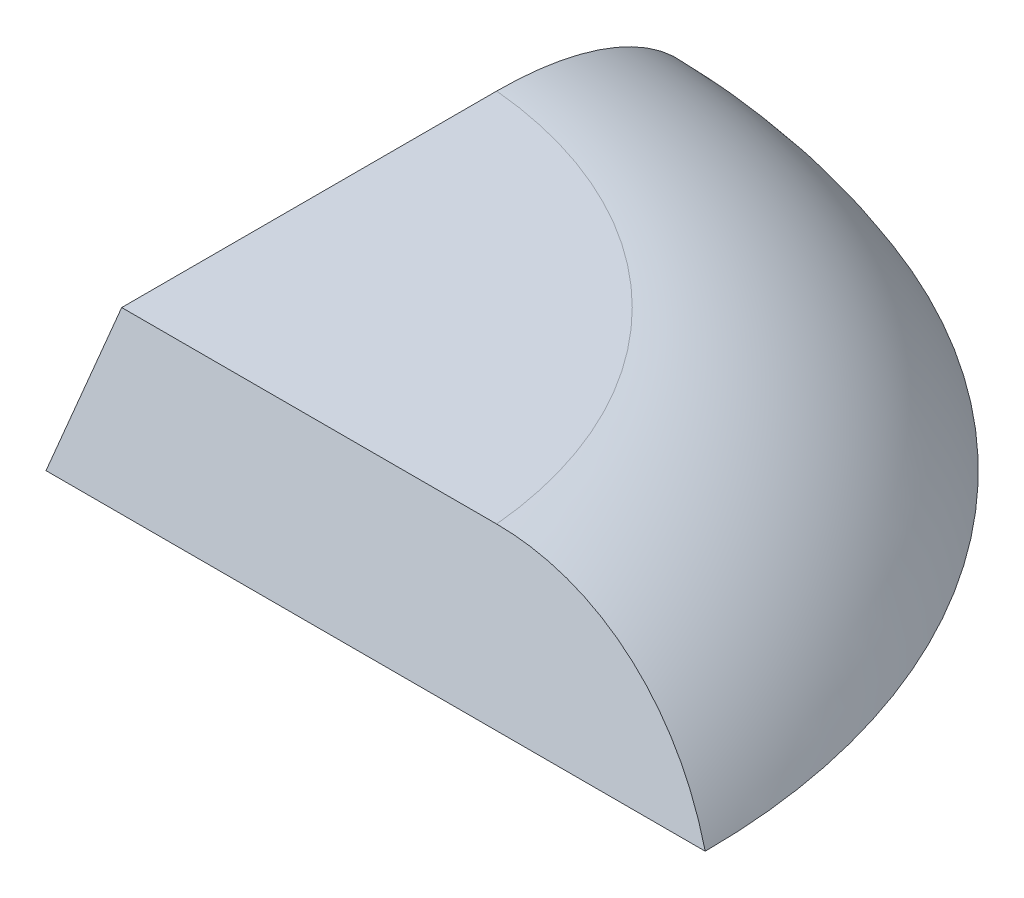
ISO-10303-21;
HEADER;
FILE_DESCRIPTION(('STEP AP214'),'2;1');
FILE_NAME('part.step','',(''),(''),'','','');
FILE_SCHEMA(('AUTOMOTIVE_DESIGN { 1 0 10303 214 1 1 1 1 }'));
ENDSEC;
DATA;
#1=APPLICATION_CONTEXT('core data for automotive mechanical design processes');
#2=APPLICATION_PROTOCOL_DEFINITION('international standard','automotive_design',2000,#1);
#3=PRODUCT_CONTEXT('',#1,'mechanical');
#4=PRODUCT('Part','Part','',(#3));
#5=PRODUCT_RELATED_PRODUCT_CATEGORY('part','',(#4));
#6=PRODUCT_DEFINITION_FORMATION('','',#4);
#7=PRODUCT_DEFINITION_CONTEXT('part definition',#1,'design');
#8=PRODUCT_DEFINITION('design','',#6,#7);
#9=PRODUCT_DEFINITION_SHAPE('','',#8);
#10=(LENGTH_UNIT() NAMED_UNIT(*) SI_UNIT(.MILLI.,.METRE.));
#11=(NAMED_UNIT(*) PLANE_ANGLE_UNIT() SI_UNIT($,.RADIAN.));
#12=(NAMED_UNIT(*) SI_UNIT($,.STERADIAN.) SOLID_ANGLE_UNIT());
#13=UNCERTAINTY_MEASURE_WITH_UNIT(LENGTH_MEASURE(1.E-05),#10,'distance_accuracy_value','');
#14=(GEOMETRIC_REPRESENTATION_CONTEXT(3) GLOBAL_UNCERTAINTY_ASSIGNED_CONTEXT((#13)) GLOBAL_UNIT_ASSIGNED_CONTEXT((#10,
#11,#12)) REPRESENTATION_CONTEXT('',''));
#15=CARTESIAN_POINT('',(0.,0.,0.));
#16=DIRECTION('',(0.,0.,1.));
#17=DIRECTION('',(1.,0.,0.));
#18=AXIS2_PLACEMENT_3D('',#15,#16,#17);
#19=CARTESIAN_POINT('',(-17.0441837358943,0.,17.0441837358943));
#20=DIRECTION('',(0.,0.258819045102521,0.965925826289068));
#21=DIRECTION('',(0.,-0.965925826289068,0.258819045102521));
#22=AXIS2_PLACEMENT_3D('',#19,#20,#21);
#23=PLANE('',#22);
#24=DIRECTION('',(1.,0.,0.));
#25=VECTOR('',#24,1.);
#26=CARTESIAN_POINT('',(-17.0441837358943,0.,17.0441837358943));
#27=LINE('',#26,#25);
#28=CARTESIAN_POINT('',(-17.0441837358943,0.,17.0441837358943));
#29=VERTEX_POINT('',#28);
#30=CARTESIAN_POINT('',(-3.04418373589434,0.,17.0441837358943));
#31=VERTEX_POINT('',#30);
#32=EDGE_CURVE('E75',#29,#31,#27,.T.);
#33=ORIENTED_EDGE('',*,*,#32,.T.);
#34=CARTESIAN_POINT('',(-3.04418373589434,0.,17.0441837358943));
#35=CARTESIAN_POINT('',(-3.12753855661707,0.144409872264248,17.0054892272421));
#36=CARTESIAN_POINT('',(-3.21716871842496,0.285440991333556,16.9677000527798));
#37=CARTESIAN_POINT('',(-3.40832179002279,0.559775219056655,16.8941924180052));
#38=CARTESIAN_POINT('',(-3.50984493036635,0.693078177819809,16.8584739978559));
#39=CARTESIAN_POINT('',(-3.72405839763664,0.95090246233359,16.7893901890313));
#40=CARTESIAN_POINT('',(-3.8367419813405,1.07542901393416,16.7560234000937));
#41=CARTESIAN_POINT('',(-4.0725573785878,1.3148757815413,16.6918638320831));
#42=CARTESIAN_POINT('',(-4.19568885844701,1.42979630411208,16.6610709708665));
#43=CARTESIAN_POINT('',(-4.45165223664817,1.64925747229645,16.6022665280815));
#44=CARTESIAN_POINT('',(-4.58449084130876,1.75379082183612,16.5742569014902));
#45=CARTESIAN_POINT('',(-4.85887380193164,1.95159602197242,16.521255157855));
#46=CARTESIAN_POINT('',(-5.00041825630385,2.04486774523362,16.4962630749305));
#47=CARTESIAN_POINT('',(-5.29127271156627,2.2194588199678,16.4494815374498));
#48=CARTESIAN_POINT('',(-5.44058554013154,2.30077377740343,16.4276932602724));
#49=CARTESIAN_POINT('',(-5.74586071165762,2.4507606302755,16.38750440417));
#50=CARTESIAN_POINT('',(-5.90182267535026,2.51943324564884,16.3691036323386));
#51=CARTESIAN_POINT('',(-6.21774895963203,2.64297899311939,16.3359996490756));
#52=CARTESIAN_POINT('',(-6.37766020548148,2.69797876791152,16.3212625038361));
#53=CARTESIAN_POINT('',(-6.70176210813462,2.79456735805591,16.2953816691089));
#54=CARTESIAN_POINT('',(-6.86595253512457,2.83615689200864,16.2842377870727));
#55=CARTESIAN_POINT('',(-7.19708281053465,2.90548771225778,16.2656606497763));
#56=CARTESIAN_POINT('',(-7.36401644589814,2.93325675926462,16.2582199560562));
#57=CARTESIAN_POINT('',(-7.69966359261924,2.97478572499434,16.2470923032265));
#58=CARTESIAN_POINT('',(-7.86837580936791,2.98855520651872,16.2434027817718));
#59=CARTESIAN_POINT('',(-8.07728354144956,2.99683347228626,16.2411846271447));
#60=CARTESIAN_POINT('',(-8.11725874476096,2.99802119211297,16.2408663785763));
#61=CARTESIAN_POINT('',(-8.19719178454703,2.99960397789834,16.2404422724033));
#62=CARTESIAN_POINT('',(-8.23714960666078,2.9999997205014,16.2403362334924));
#63=CARTESIAN_POINT('',(-8.27711117792529,3.,16.240336158601));
#64=B_SPLINE_CURVE_WITH_KNOTS('',3,(#34,#35,#36,#37,#38,#39,#40,#41,#42,#43,#44,#45,#46,#47,#48,
#49,#50,#51,#52,#53,#54,#55,#56,#57,#58,#59,#60,#61,#62,#63),.UNSPECIFIED.,.F.,.F.,(4,2,2,2,2,2,
2,2,2,2,2,2,2,2,4),(0.,0.51336529775215,1.02674054909256,1.53980748593984,2.05285804265174,
2.56626646187149,3.07968068566677,3.59328311697483,4.10685629137846,4.61547872762745,
5.12407390433009,5.63164331916973,6.1388657908688,6.25884346569189,6.37871859092539),.UNSPECIFIED.);
#65=CARTESIAN_POINT('',(-8.2771111779253,3.,16.240336158601));
#66=VERTEX_POINT('',#65);
#67=EDGE_CURVE('E11',#31,#66,#64,.T.);
#68=ORIENTED_EDGE('',*,*,#67,.T.);
#69=DIRECTION('',(-1.,0.,0.));
#70=VECTOR('',#69,1.);
#71=CARTESIAN_POINT('',(-17.0441837358943,3.,16.240336158601));
#72=LINE('',#71,#70);
#73=CARTESIAN_POINT('',(-16.240336158601,3.,16.240336158601));
#74=VERTEX_POINT('',#73);
#75=EDGE_CURVE('E106',#74,#66,#72,.F.);
#76=ORIENTED_EDGE('',*,*,#75,.F.);
#77=DIRECTION('',(-0.250562807085732,-0.935113126531029,0.250562807085732));
#78=VECTOR('',#77,1.);
#79=CARTESIAN_POINT('',(-17.0441837358943,0.,17.0441837358943));
#80=LINE('',#79,#78);
#81=EDGE_CURVE('E80',#74,#29,#80,.T.);
#82=ORIENTED_EDGE('',*,*,#81,.T.);
#83=EDGE_LOOP('',(#33,#68,#76,#82));
#84=FACE_BOUND('',#83,.T.);
#85=ADVANCED_FACE('F33',(#84),#23,.T.);
#86=CARTESIAN_POINT('',(-17.0441837358943,0.,3.04418373589434));
#87=DIRECTION('',(-0.965925826289068,0.258819045102521,0.));
#88=DIRECTION('',(-0.258819045102521,-0.965925826289068,0.));
#89=AXIS2_PLACEMENT_3D('',#86,#87,#88);
#90=PLANE('',#89);
#91=DIRECTION('',(0.,0.,-1.));
#92=VECTOR('',#91,1.);
#93=CARTESIAN_POINT('',(-16.240336158601,3.,17.0441837358943));
#94=LINE('',#93,#92);
#95=CARTESIAN_POINT('',(-16.240336158601,3.,8.2771111779253));
#96=VERTEX_POINT('',#95);
#97=EDGE_CURVE('E86',#96,#74,#94,.F.);
#98=ORIENTED_EDGE('',*,*,#97,.F.);
#99=CARTESIAN_POINT('',(-16.240336158601,3.,8.27711117792529));
#100=CARTESIAN_POINT('',(-16.2403289912065,3.00002674908014,8.08872289268257));
#101=CARTESIAN_POINT('',(-16.2426935081103,2.99120225186007,7.90035435335059));
#102=CARTESIAN_POINT('',(-16.2520860590193,2.95614877465473,7.5253769539243));
#103=CARTESIAN_POINT('',(-16.259113646184,2.92992146230175,7.33876792696151));
#104=CARTESIAN_POINT('',(-16.2777145209522,2.86050205260134,6.96974675282083));
#105=CARTESIAN_POINT('',(-16.2892691594512,2.81737955466017,6.78732059707294));
#106=CARTESIAN_POINT('',(-16.3167854048291,2.71468752887634,6.42757085679597));
#107=CARTESIAN_POINT('',(-16.3327465044678,2.65511989407983,6.25024668755554));
#108=CARTESIAN_POINT('',(-16.382834050082,2.46819062902138,5.76839607881451));
#109=CARTESIAN_POINT('',(-16.4214991016677,2.32389069202613,5.4707258319329));
#110=CARTESIAN_POINT('',(-16.5110112911173,1.98982665310356,4.90399510867711));
#111=CARTESIAN_POINT('',(-16.5618627657157,1.80004636626267,4.63494486651751));
#112=CARTESIAN_POINT('',(-16.6480800830082,1.47827895763465,4.2494845638597));
#113=CARTESIAN_POINT('',(-16.6796725093627,1.36037441734532,4.12020744953998));
#114=CARTESIAN_POINT('',(-16.7456713883541,1.11406324770669,3.87277521593978));
#115=CARTESIAN_POINT('',(-16.780078109001,0.985655618130899,3.75462115823628));
#116=CARTESIAN_POINT('',(-16.8514781899502,0.719186888364002,3.53019347174576));
#117=CARTESIAN_POINT('',(-16.8884753679903,0.581111540181367,3.42393800431209));
#118=CARTESIAN_POINT('',(-16.9647166068942,0.296575362960204,3.22425730129206));
#119=CARTESIAN_POINT('',(-17.0039604981618,0.150115166862666,3.13083109907682));
#120=CARTESIAN_POINT('',(-17.0441837358943,0.,3.04418373589433));
#121=B_SPLINE_CURVE_WITH_KNOTS('',3,(#99,#100,#101,#102,#103,#104,#105,#106,#107,#108,#109,#110,
#111,#112,#113,#114,#115,#116,#117,#118,#119,#120),.UNSPECIFIED.,.F.,.F.,(4,2,2,2,2,2,2,2,2,2,
4),(0.,0.564912318622437,1.12977051209366,1.69232584350891,2.25481644457329,3.24913503410561,
4.24380799471296,4.77661936889812,5.30948154279587,5.84314627026064,6.37677076634037),.UNSPECIFIED.);
#122=CARTESIAN_POINT('',(-17.0441837358943,0.,3.04418373589434));
#123=VERTEX_POINT('',#122);
#124=EDGE_CURVE('E46',#96,#123,#121,.T.);
#125=ORIENTED_EDGE('',*,*,#124,.T.);
#126=DIRECTION('',(0.,0.,1.));
#127=VECTOR('',#126,1.);
#128=CARTESIAN_POINT('',(-17.0441837358943,0.,3.04418373589434));
#129=LINE('',#128,#127);
#130=EDGE_CURVE('E76',#123,#29,#129,.T.);
#131=ORIENTED_EDGE('',*,*,#130,.T.);
#132=ORIENTED_EDGE('',*,*,#81,.F.);
#133=EDGE_LOOP('',(#98,#125,#131,#132));
#134=FACE_BOUND('',#133,.T.);
#135=ADVANCED_FACE('F93',(#134),#90,.T.);
#136=CARTESIAN_POINT('',(-17.0441837358943,3.,17.0441837358943));
#137=DIRECTION('',(0.,-1.,0.));
#138=DIRECTION('',(0.,0.,-1.));
#139=AXIS2_PLACEMENT_3D('',#136,#137,#138);
#140=PLANE('',#139);
#141=ORIENTED_EDGE('',*,*,#75,.T.);
#142=CARTESIAN_POINT('',(-17.0441837358943,3.,17.0441837358943));
#143=DIRECTION('',(0.,-1.,0.));
#144=DIRECTION('',(0.,0.,-1.));
#145=AXIS2_PLACEMENT_3D('',#142,#143,#144);
#146=CIRCLE('',#145,8.80384757729337);
#147=EDGE_CURVE('E82',#66,#96,#146,.F.);
#148=ORIENTED_EDGE('',*,*,#147,.T.);
#149=ORIENTED_EDGE('',*,*,#97,.T.);
#150=EDGE_LOOP('',(#141,#148,#149));
#151=FACE_BOUND('',#150,.T.);
#152=ADVANCED_FACE('F96',(#151),#140,.F.);
#153=CARTESIAN_POINT('',(-17.0441837358943,0.,17.0441837358943));
#154=DIRECTION('',(0.,-1.,0.));
#155=DIRECTION('',(0.,0.,-1.));
#156=AXIS2_PLACEMENT_3D('',#153,#154,#155);
#157=PLANE('',#156);
#158=ORIENTED_EDGE('',*,*,#32,.F.);
#159=ORIENTED_EDGE('',*,*,#130,.F.);
#160=CARTESIAN_POINT('',(-17.0441837358943,0.,17.0441837358943));
#161=DIRECTION('',(0.,1.,0.));
#162=DIRECTION('',(0.,0.,-1.));
#163=AXIS2_PLACEMENT_3D('',#160,#161,#162);
#164=CIRCLE('',#163,14.);
#165=EDGE_CURVE('E73',#31,#123,#164,.T.);
#166=ORIENTED_EDGE('',*,*,#165,.F.);
#167=EDGE_LOOP('',(#158,#159,#166));
#168=FACE_BOUND('',#167,.T.);
#169=ADVANCED_FACE('F74',(#168),#157,.T.);
#170=CARTESIAN_POINT('',(-17.0441837358943,-3.,17.0441837358943));
#171=DIRECTION('',(0.,1.,0.));
#172=DIRECTION('',(0.,0.,1.));
#173=AXIS2_PLACEMENT_3D('',#170,#171,#172);
#174=TOROIDAL_SURFACE('',#173,8.80384757729337,6.);
#175=ORIENTED_EDGE('',*,*,#67,.F.);
#176=ORIENTED_EDGE('',*,*,#165,.T.);
#177=ORIENTED_EDGE('',*,*,#124,.F.);
#178=ORIENTED_EDGE('',*,*,#147,.F.);
#179=EDGE_LOOP('',(#175,#176,#177,#178));
#180=FACE_BOUND('',#179,.T.);
#181=ADVANCED_FACE('F35',(#180),#174,.T.);
#182=CLOSED_SHELL('',(#85,#135,#152,#169,#181));
#183=MANIFOLD_SOLID_BREP('B2',#182);
#184=ADVANCED_BREP_SHAPE_REPRESENTATION('',(#18,#183),#14);
#185=SHAPE_DEFINITION_REPRESENTATION(#9,#184);
ENDSEC;
END-ISO-10303-21;
